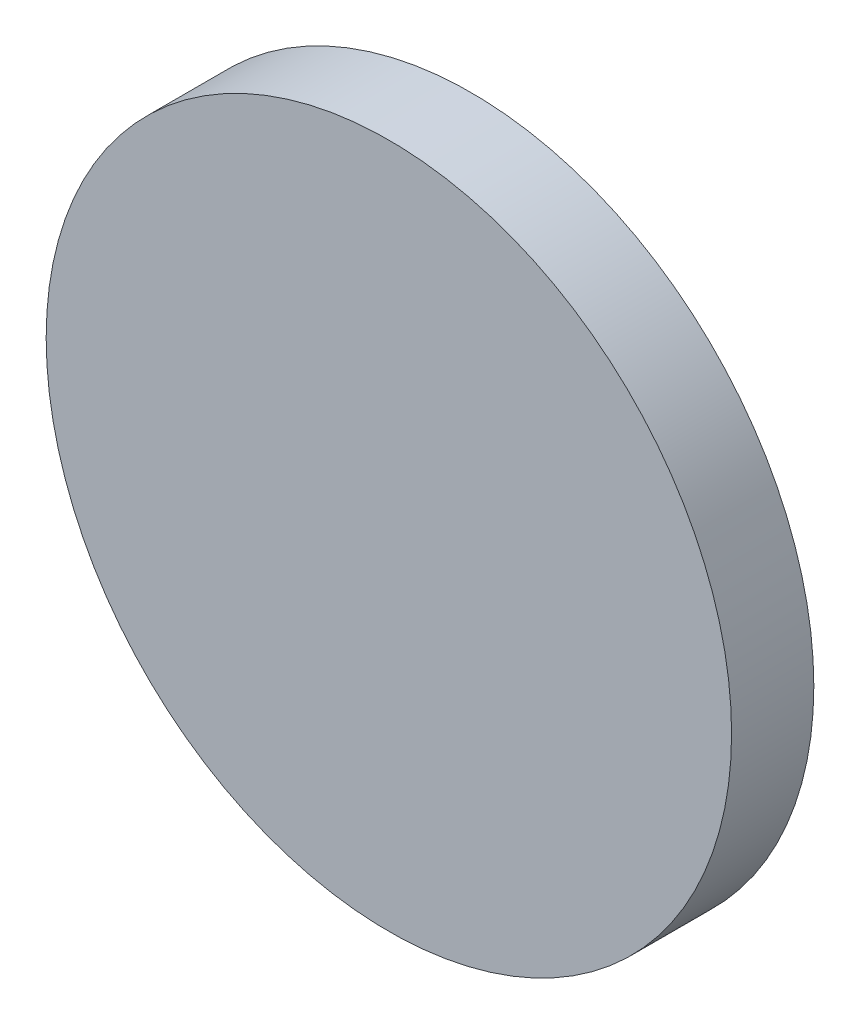
ISO-10303-21;
HEADER;
FILE_DESCRIPTION(('STEP AP214'),'2;1');
FILE_NAME('part.step','',(''),(''),'','','');
FILE_SCHEMA(('AUTOMOTIVE_DESIGN { 1 0 10303 214 1 1 1 1 }'));
ENDSEC;
DATA;
#1=APPLICATION_CONTEXT('core data for automotive mechanical design processes');
#2=APPLICATION_PROTOCOL_DEFINITION('international standard','automotive_design',2000,#1);
#3=PRODUCT_CONTEXT('',#1,'mechanical');
#4=PRODUCT('Part','Part','',(#3));
#5=PRODUCT_RELATED_PRODUCT_CATEGORY('part','',(#4));
#6=PRODUCT_DEFINITION_FORMATION('','',#4);
#7=PRODUCT_DEFINITION_CONTEXT('part definition',#1,'design');
#8=PRODUCT_DEFINITION('design','',#6,#7);
#9=PRODUCT_DEFINITION_SHAPE('','',#8);
#10=(LENGTH_UNIT() NAMED_UNIT(*) SI_UNIT(.MILLI.,.METRE.));
#11=(NAMED_UNIT(*) PLANE_ANGLE_UNIT() SI_UNIT($,.RADIAN.));
#12=(NAMED_UNIT(*) SI_UNIT($,.STERADIAN.) SOLID_ANGLE_UNIT());
#13=UNCERTAINTY_MEASURE_WITH_UNIT(LENGTH_MEASURE(1.E-05),#10,'distance_accuracy_value','');
#14=(GEOMETRIC_REPRESENTATION_CONTEXT(3) GLOBAL_UNCERTAINTY_ASSIGNED_CONTEXT((#13)) GLOBAL_UNIT_ASSIGNED_CONTEXT((#10,
#11,#12)) REPRESENTATION_CONTEXT('',''));
#15=CARTESIAN_POINT('',(0.,0.,0.));
#16=DIRECTION('',(0.,0.,1.));
#17=DIRECTION('',(1.,0.,0.));
#18=AXIS2_PLACEMENT_3D('',#15,#16,#17);
#19=CARTESIAN_POINT('',(0.,0.,3.));
#20=DIRECTION('',(0.,0.,-1.));
#21=DIRECTION('',(-1.,0.,0.));
#22=AXIS2_PLACEMENT_3D('',#19,#20,#21);
#23=CYLINDRICAL_SURFACE('',#22,12.5);
#24=CARTESIAN_POINT('',(0.,0.,3.));
#25=DIRECTION('',(0.,0.,1.));
#26=DIRECTION('',(1.,0.,0.));
#27=AXIS2_PLACEMENT_3D('',#24,#25,#26);
#28=CIRCLE('',#27,12.5);
#29=CARTESIAN_POINT('',(12.5,0.,3.));
#30=VERTEX_POINT('',#29);
#31=EDGE_CURVE('E10',#30,#30,#28,.T.);
#32=ORIENTED_EDGE('',*,*,#31,.F.);
#33=EDGE_LOOP('',(#32));
#34=FACE_BOUND('',#33,.T.);
#35=CARTESIAN_POINT('',(0.,0.,0.));
#36=DIRECTION('',(0.,0.,1.));
#37=DIRECTION('',(1.,0.,0.));
#38=AXIS2_PLACEMENT_3D('',#35,#36,#37);
#39=CIRCLE('',#38,12.5);
#40=CARTESIAN_POINT('',(12.5,0.,0.));
#41=VERTEX_POINT('',#40);
#42=EDGE_CURVE('E34',#41,#41,#39,.T.);
#43=ORIENTED_EDGE('',*,*,#42,.T.);
#44=EDGE_LOOP('',(#43));
#45=FACE_BOUND('',#44,.T.);
#46=ADVANCED_FACE('F31',(#34,#45),#23,.T.);
#47=CARTESIAN_POINT('',(0.,0.,3.));
#48=DIRECTION('',(0.,0.,1.));
#49=DIRECTION('',(1.,0.,0.));
#50=AXIS2_PLACEMENT_3D('',#47,#48,#49);
#51=PLANE('',#50);
#52=ORIENTED_EDGE('',*,*,#31,.T.);
#53=EDGE_LOOP('',(#52));
#54=FACE_BOUND('',#53,.T.);
#55=ADVANCED_FACE('F46',(#54),#51,.T.);
#56=CARTESIAN_POINT('',(0.,0.,0.));
#57=DIRECTION('',(0.,0.,1.));
#58=DIRECTION('',(1.,0.,0.));
#59=AXIS2_PLACEMENT_3D('',#56,#57,#58);
#60=PLANE('',#59);
#61=ORIENTED_EDGE('',*,*,#42,.F.);
#62=EDGE_LOOP('',(#61));
#63=FACE_BOUND('',#62,.T.);
#64=ADVANCED_FACE('F44',(#63),#60,.F.);
#65=CLOSED_SHELL('',(#46,#55,#64));
#66=MANIFOLD_SOLID_BREP('B2',#65);
#67=ADVANCED_BREP_SHAPE_REPRESENTATION('',(#18,#66),#14);
#68=SHAPE_DEFINITION_REPRESENTATION(#9,#67);
ENDSEC;
END-ISO-10303-21;
